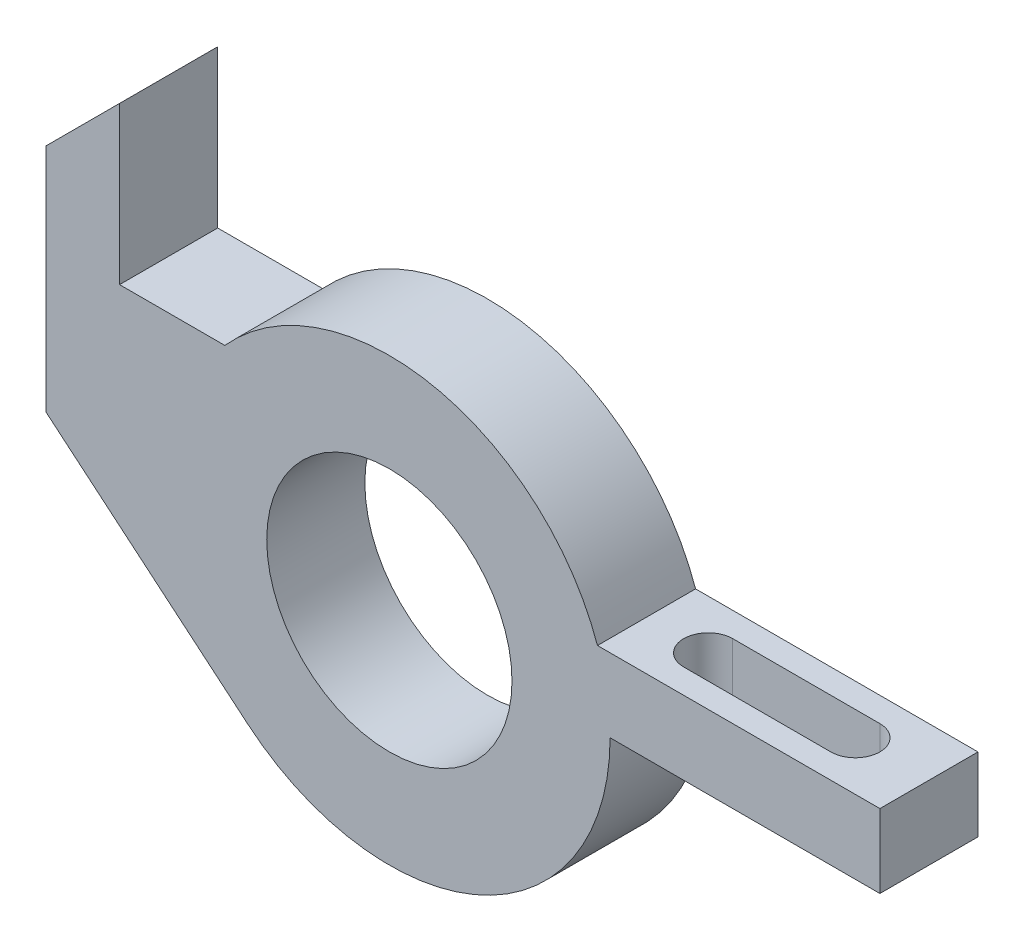
ISO-10303-21;
HEADER;
FILE_DESCRIPTION(('STEP AP214'),'2;1');
FILE_NAME('part.step','',(''),(''),'','','');
FILE_SCHEMA(('AUTOMOTIVE_DESIGN { 1 0 10303 214 1 1 1 1 }'));
ENDSEC;
DATA;
#1=APPLICATION_CONTEXT('core data for automotive mechanical design processes');
#2=APPLICATION_PROTOCOL_DEFINITION('international standard','automotive_design',2000,#1);
#3=PRODUCT_CONTEXT('',#1,'mechanical');
#4=PRODUCT('Part','Part','',(#3));
#5=PRODUCT_RELATED_PRODUCT_CATEGORY('part','',(#4));
#6=PRODUCT_DEFINITION_FORMATION('','',#4);
#7=PRODUCT_DEFINITION_CONTEXT('part definition',#1,'design');
#8=PRODUCT_DEFINITION('design','',#6,#7);
#9=PRODUCT_DEFINITION_SHAPE('','',#8);
#10=(LENGTH_UNIT() NAMED_UNIT(*) SI_UNIT(.MILLI.,.METRE.));
#11=(NAMED_UNIT(*) PLANE_ANGLE_UNIT() SI_UNIT($,.RADIAN.));
#12=(NAMED_UNIT(*) SI_UNIT($,.STERADIAN.) SOLID_ANGLE_UNIT());
#13=UNCERTAINTY_MEASURE_WITH_UNIT(LENGTH_MEASURE(1.E-05),#10,'distance_accuracy_value','');
#14=(GEOMETRIC_REPRESENTATION_CONTEXT(3) GLOBAL_UNCERTAINTY_ASSIGNED_CONTEXT((#13)) GLOBAL_UNIT_ASSIGNED_CONTEXT((#10,
#11,#12)) REPRESENTATION_CONTEXT('',''));
#15=CARTESIAN_POINT('',(0.,0.,0.));
#16=DIRECTION('',(0.,0.,1.));
#17=DIRECTION('',(1.,0.,0.));
#18=AXIS2_PLACEMENT_3D('',#15,#16,#17);
#19=CARTESIAN_POINT('',(0.,0.,20.));
#20=DIRECTION('',(0.,0.,1.));
#21=DIRECTION('',(1.,0.,0.));
#22=AXIS2_PLACEMENT_3D('',#19,#20,#21);
#23=PLANE('',#22);
#24=DIRECTION('',(0.,-1.,0.));
#25=VECTOR('',#24,1.);
#26=CARTESIAN_POINT('',(-70.,0.,20.));
#27=LINE('',#26,#25);
#28=CARTESIAN_POINT('',(-70.,47.,20.));
#29=VERTEX_POINT('',#28);
#30=CARTESIAN_POINT('',(-70.,0.,20.));
#31=VERTEX_POINT('',#30);
#32=EDGE_CURVE('E178',#29,#31,#27,.T.);
#33=ORIENTED_EDGE('',*,*,#32,.T.);
#34=DIRECTION('',(0.765986092483115,-0.642857142857143,0.));
#35=VECTOR('',#34,1.);
#36=CARTESIAN_POINT('',(-70.,0.,20.));
#37=LINE('',#36,#35);
#38=CARTESIAN_POINT('',(-28.9285714285714,-34.4693741617402,20.));
#39=VERTEX_POINT('',#38);
#40=EDGE_CURVE('E181',#31,#39,#37,.T.);
#41=ORIENTED_EDGE('',*,*,#40,.T.);
#42=CARTESIAN_POINT('',(0.,0.,20.));
#43=DIRECTION('',(0.,0.,1.));
#44=DIRECTION('',(1.,0.,0.));
#45=AXIS2_PLACEMENT_3D('',#42,#43,#44);
#46=CIRCLE('',#45,45.);
#47=CARTESIAN_POINT('',(45.,0.,20.));
#48=VERTEX_POINT('',#47);
#49=EDGE_CURVE('E184',#39,#48,#46,.T.);
#50=ORIENTED_EDGE('',*,*,#49,.T.);
#51=DIRECTION('',(1.,0.,0.));
#52=VECTOR('',#51,1.);
#53=CARTESIAN_POINT('',(44.9999999999999,0.,20.));
#54=LINE('',#53,#52);
#55=CARTESIAN_POINT('',(100.,0.,20.));
#56=VERTEX_POINT('',#55);
#57=EDGE_CURVE('E186',#48,#56,#54,.T.);
#58=ORIENTED_EDGE('',*,*,#57,.T.);
#59=DIRECTION('',(0.,1.,0.));
#60=VECTOR('',#59,1.);
#61=CARTESIAN_POINT('',(100.,15.,20.));
#62=LINE('',#61,#60);
#63=CARTESIAN_POINT('',(100.,15.,20.));
#64=VERTEX_POINT('',#63);
#65=EDGE_CURVE('E188',#56,#64,#62,.T.);
#66=ORIENTED_EDGE('',*,*,#65,.T.);
#67=DIRECTION('',(-1.,0.,0.));
#68=VECTOR('',#67,1.);
#69=CARTESIAN_POINT('',(42.4264068711928,15.,20.));
#70=LINE('',#69,#68);
#71=CARTESIAN_POINT('',(42.4264068711928,15.,20.));
#72=VERTEX_POINT('',#71);
#73=EDGE_CURVE('E190',#64,#72,#70,.T.);
#74=ORIENTED_EDGE('',*,*,#73,.T.);
#75=CARTESIAN_POINT('',(0.,0.,20.));
#76=DIRECTION('',(0.,0.,1.));
#77=DIRECTION('',(1.,0.,0.));
#78=AXIS2_PLACEMENT_3D('',#75,#76,#77);
#79=CIRCLE('',#78,45.);
#80=CARTESIAN_POINT('',(-33.5410196624968,30.,20.));
#81=VERTEX_POINT('',#80);
#82=EDGE_CURVE('E192',#72,#81,#79,.T.);
#83=ORIENTED_EDGE('',*,*,#82,.T.);
#84=DIRECTION('',(-1.,0.,0.));
#85=VECTOR('',#84,1.);
#86=CARTESIAN_POINT('',(-55.,30.,20.));
#87=LINE('',#86,#85);
#88=CARTESIAN_POINT('',(-55.,30.,20.));
#89=VERTEX_POINT('',#88);
#90=EDGE_CURVE('E194',#81,#89,#87,.T.);
#91=ORIENTED_EDGE('',*,*,#90,.T.);
#92=DIRECTION('',(0.,1.,0.));
#93=VECTOR('',#92,1.);
#94=CARTESIAN_POINT('',(-55.,62.,20.));
#95=LINE('',#94,#93);
#96=CARTESIAN_POINT('',(-55.,62.,20.));
#97=VERTEX_POINT('',#96);
#98=EDGE_CURVE('E196',#89,#97,#95,.T.);
#99=ORIENTED_EDGE('',*,*,#98,.T.);
#100=DIRECTION('',(-0.707106781186547,-0.707106781186548,0.));
#101=VECTOR('',#100,1.);
#102=CARTESIAN_POINT('',(-70.,47.,20.));
#103=LINE('',#102,#101);
#104=EDGE_CURVE('E198',#97,#29,#103,.T.);
#105=ORIENTED_EDGE('',*,*,#104,.T.);
#106=EDGE_LOOP('',(#33,#41,#50,#58,#66,#74,#83,#91,#99,#105));
#107=FACE_BOUND('',#106,.T.);
#108=CARTESIAN_POINT('',(0.,0.,20.));
#109=DIRECTION('',(0.,0.,1.));
#110=DIRECTION('',(1.,0.,0.));
#111=AXIS2_PLACEMENT_3D('',#108,#109,#110);
#112=CIRCLE('',#111,25.);
#113=CARTESIAN_POINT('',(25.,0.,20.));
#114=VERTEX_POINT('',#113);
#115=EDGE_CURVE('E172',#114,#114,#112,.T.);
#116=ORIENTED_EDGE('',*,*,#115,.F.);
#117=EDGE_LOOP('',(#116));
#118=FACE_BOUND('',#117,.T.);
#119=ADVANCED_FACE('F33',(#107,#118),#23,.T.);
#120=CARTESIAN_POINT('',(0.,0.,0.));
#121=DIRECTION('',(0.,0.,1.));
#122=DIRECTION('',(1.,0.,0.));
#123=AXIS2_PLACEMENT_3D('',#120,#121,#122);
#124=PLANE('',#123);
#125=DIRECTION('',(0.,-1.,0.));
#126=VECTOR('',#125,1.);
#127=CARTESIAN_POINT('',(-70.,0.,0.));
#128=LINE('',#127,#126);
#129=CARTESIAN_POINT('',(-70.,47.,0.));
#130=VERTEX_POINT('',#129);
#131=CARTESIAN_POINT('',(-70.,0.,0.));
#132=VERTEX_POINT('',#131);
#133=EDGE_CURVE('E175',#130,#132,#128,.T.);
#134=ORIENTED_EDGE('',*,*,#133,.F.);
#135=DIRECTION('',(-0.707106781186547,-0.707106781186548,0.));
#136=VECTOR('',#135,1.);
#137=CARTESIAN_POINT('',(-70.,47.,0.));
#138=LINE('',#137,#136);
#139=CARTESIAN_POINT('',(-55.,62.,0.));
#140=VERTEX_POINT('',#139);
#141=EDGE_CURVE('E182',#140,#130,#138,.T.);
#142=ORIENTED_EDGE('',*,*,#141,.F.);
#143=DIRECTION('',(0.,1.,0.));
#144=VECTOR('',#143,1.);
#145=CARTESIAN_POINT('',(-55.,62.,0.));
#146=LINE('',#145,#144);
#147=CARTESIAN_POINT('',(-55.,30.,0.));
#148=VERTEX_POINT('',#147);
#149=EDGE_CURVE('E217',#148,#140,#146,.T.);
#150=ORIENTED_EDGE('',*,*,#149,.F.);
#151=DIRECTION('',(-1.,0.,0.));
#152=VECTOR('',#151,1.);
#153=CARTESIAN_POINT('',(-55.,30.,0.));
#154=LINE('',#153,#152);
#155=CARTESIAN_POINT('',(-33.5410196624968,30.,0.));
#156=VERTEX_POINT('',#155);
#157=EDGE_CURVE('E215',#156,#148,#154,.T.);
#158=ORIENTED_EDGE('',*,*,#157,.F.);
#159=CARTESIAN_POINT('',(0.,0.,0.));
#160=DIRECTION('',(0.,0.,1.));
#161=DIRECTION('',(1.,0.,0.));
#162=AXIS2_PLACEMENT_3D('',#159,#160,#161);
#163=CIRCLE('',#162,45.);
#164=CARTESIAN_POINT('',(42.4264068711928,15.,0.));
#165=VERTEX_POINT('',#164);
#166=EDGE_CURVE('E213',#165,#156,#163,.T.);
#167=ORIENTED_EDGE('',*,*,#166,.F.);
#168=DIRECTION('',(-1.,0.,0.));
#169=VECTOR('',#168,1.);
#170=CARTESIAN_POINT('',(42.4264068711928,15.,0.));
#171=LINE('',#170,#169);
#172=CARTESIAN_POINT('',(100.,15.,0.));
#173=VERTEX_POINT('',#172);
#174=EDGE_CURVE('E211',#173,#165,#171,.T.);
#175=ORIENTED_EDGE('',*,*,#174,.F.);
#176=DIRECTION('',(0.,1.,0.));
#177=VECTOR('',#176,1.);
#178=CARTESIAN_POINT('',(100.,15.,0.));
#179=LINE('',#178,#177);
#180=CARTESIAN_POINT('',(100.,0.,0.));
#181=VERTEX_POINT('',#180);
#182=EDGE_CURVE('E209',#181,#173,#179,.T.);
#183=ORIENTED_EDGE('',*,*,#182,.F.);
#184=DIRECTION('',(1.,0.,0.));
#185=VECTOR('',#184,1.);
#186=CARTESIAN_POINT('',(44.9999999999999,0.,0.));
#187=LINE('',#186,#185);
#188=CARTESIAN_POINT('',(45.,0.,0.));
#189=VERTEX_POINT('',#188);
#190=EDGE_CURVE('E207',#189,#181,#187,.T.);
#191=ORIENTED_EDGE('',*,*,#190,.F.);
#192=CARTESIAN_POINT('',(0.,0.,0.));
#193=DIRECTION('',(0.,0.,1.));
#194=DIRECTION('',(1.,0.,0.));
#195=AXIS2_PLACEMENT_3D('',#192,#193,#194);
#196=CIRCLE('',#195,45.);
#197=CARTESIAN_POINT('',(-28.9285714285714,-34.4693741617402,0.));
#198=VERTEX_POINT('',#197);
#199=EDGE_CURVE('E205',#198,#189,#196,.T.);
#200=ORIENTED_EDGE('',*,*,#199,.F.);
#201=DIRECTION('',(0.765986092483115,-0.642857142857143,0.));
#202=VECTOR('',#201,1.);
#203=CARTESIAN_POINT('',(-70.,0.,0.));
#204=LINE('',#203,#202);
#205=EDGE_CURVE('E203',#132,#198,#204,.T.);
#206=ORIENTED_EDGE('',*,*,#205,.F.);
#207=EDGE_LOOP('',(#134,#142,#150,#158,#167,#175,#183,#191,#200,#206));
#208=FACE_BOUND('',#207,.T.);
#209=CARTESIAN_POINT('',(0.,0.,0.));
#210=DIRECTION('',(0.,0.,1.));
#211=DIRECTION('',(1.,0.,0.));
#212=AXIS2_PLACEMENT_3D('',#209,#210,#211);
#213=CIRCLE('',#212,25.);
#214=CARTESIAN_POINT('',(25.,0.,0.));
#215=VERTEX_POINT('',#214);
#216=EDGE_CURVE('E171',#215,#215,#213,.T.);
#217=ORIENTED_EDGE('',*,*,#216,.T.);
#218=EDGE_LOOP('',(#217));
#219=FACE_BOUND('',#218,.T.);
#220=ADVANCED_FACE('F253',(#208,#219),#124,.F.);
#221=CARTESIAN_POINT('',(-70.,0.,20.));
#222=DIRECTION('',(1.,0.,0.));
#223=DIRECTION('',(0.,0.,-1.));
#224=AXIS2_PLACEMENT_3D('',#221,#222,#223);
#225=PLANE('',#224);
#226=ORIENTED_EDGE('',*,*,#133,.T.);
#227=DIRECTION('',(0.,0.,-1.));
#228=VECTOR('',#227,1.);
#229=CARTESIAN_POINT('',(-70.,0.,20.));
#230=LINE('',#229,#228);
#231=EDGE_CURVE('E11',#31,#132,#230,.T.);
#232=ORIENTED_EDGE('',*,*,#231,.F.);
#233=ORIENTED_EDGE('',*,*,#32,.F.);
#234=DIRECTION('',(0.,0.,-1.));
#235=VECTOR('',#234,1.);
#236=CARTESIAN_POINT('',(-70.,47.,20.));
#237=LINE('',#236,#235);
#238=EDGE_CURVE('E200',#29,#130,#237,.T.);
#239=ORIENTED_EDGE('',*,*,#238,.T.);
#240=EDGE_LOOP('',(#226,#232,#233,#239));
#241=FACE_BOUND('',#240,.T.);
#242=ADVANCED_FACE('F35',(#241),#225,.F.);
#243=CARTESIAN_POINT('',(-70.,0.,20.));
#244=DIRECTION('',(0.642857142857143,0.765986092483115,0.));
#245=DIRECTION('',(-0.765986092483115,0.642857142857143,0.));
#246=AXIS2_PLACEMENT_3D('',#243,#244,#245);
#247=PLANE('',#246);
#248=ORIENTED_EDGE('',*,*,#205,.T.);
#249=DIRECTION('',(0.,0.,-1.));
#250=VECTOR('',#249,1.);
#251=CARTESIAN_POINT('',(-28.9285714285714,-34.4693741617402,20.));
#252=LINE('',#251,#250);
#253=EDGE_CURVE('E41',#39,#198,#252,.T.);
#254=ORIENTED_EDGE('',*,*,#253,.F.);
#255=ORIENTED_EDGE('',*,*,#40,.F.);
#256=ORIENTED_EDGE('',*,*,#231,.T.);
#257=EDGE_LOOP('',(#248,#254,#255,#256));
#258=FACE_BOUND('',#257,.T.);
#259=ADVANCED_FACE('F271',(#258),#247,.F.);
#260=CARTESIAN_POINT('',(0.,0.,20.));
#261=DIRECTION('',(0.,0.,-1.));
#262=DIRECTION('',(-1.,0.,0.));
#263=AXIS2_PLACEMENT_3D('',#260,#261,#262);
#264=CYLINDRICAL_SURFACE('',#263,45.);
#265=ORIENTED_EDGE('',*,*,#199,.T.);
#266=DIRECTION('',(0.,0.,-1.));
#267=VECTOR('',#266,1.);
#268=CARTESIAN_POINT('',(45.,0.,20.));
#269=LINE('',#268,#267);
#270=EDGE_CURVE('E240',#48,#189,#269,.T.);
#271=ORIENTED_EDGE('',*,*,#270,.F.);
#272=ORIENTED_EDGE('',*,*,#49,.F.);
#273=ORIENTED_EDGE('',*,*,#253,.T.);
#274=EDGE_LOOP('',(#265,#271,#272,#273));
#275=FACE_BOUND('',#274,.T.);
#276=ADVANCED_FACE('F247',(#275),#264,.T.);
#277=CARTESIAN_POINT('',(44.9999999999999,0.,20.));
#278=DIRECTION('',(0.,1.,0.));
#279=DIRECTION('',(0.,0.,1.));
#280=AXIS2_PLACEMENT_3D('',#277,#278,#279);
#281=PLANE('',#280);
#282=DIRECTION('',(-1.,0.,0.));
#283=VECTOR('',#282,1.);
#284=CARTESIAN_POINT('',(44.9999999999999,0.,4.99999999999999));
#285=LINE('',#284,#283);
#286=CARTESIAN_POINT('',(85.,0.,4.99999999999999));
#287=VERTEX_POINT('',#286);
#288=CARTESIAN_POINT('',(55.,0.,4.99999999999999));
#289=VERTEX_POINT('',#288);
#290=EDGE_CURVE('E165',#287,#289,#285,.T.);
#291=ORIENTED_EDGE('',*,*,#290,.T.);
#292=CARTESIAN_POINT('',(55.,0.,10.));
#293=DIRECTION('',(0.,1.,0.));
#294=DIRECTION('',(0.,0.,1.));
#295=AXIS2_PLACEMENT_3D('',#292,#293,#294);
#296=CIRCLE('',#295,5.00000000000001);
#297=CARTESIAN_POINT('',(55.,0.,15.));
#298=VERTEX_POINT('',#297);
#299=EDGE_CURVE('E168',#289,#298,#296,.T.);
#300=ORIENTED_EDGE('',*,*,#299,.T.);
#301=DIRECTION('',(1.,0.,0.));
#302=VECTOR('',#301,1.);
#303=CARTESIAN_POINT('',(44.9999999999999,0.,15.));
#304=LINE('',#303,#302);
#305=CARTESIAN_POINT('',(85.,0.,15.));
#306=VERTEX_POINT('',#305);
#307=EDGE_CURVE('E160',#298,#306,#304,.T.);
#308=ORIENTED_EDGE('',*,*,#307,.T.);
#309=CARTESIAN_POINT('',(85.,0.,9.99999999999999));
#310=DIRECTION('',(0.,1.,0.));
#311=DIRECTION('',(0.,0.,1.));
#312=AXIS2_PLACEMENT_3D('',#309,#310,#311);
#313=CIRCLE('',#312,5.);
#314=EDGE_CURVE('E140',#306,#287,#313,.T.);
#315=ORIENTED_EDGE('',*,*,#314,.T.);
#316=EDGE_LOOP('',(#291,#300,#308,#315));
#317=FACE_BOUND('',#316,.T.);
#318=ORIENTED_EDGE('',*,*,#190,.T.);
#319=DIRECTION('',(0.,0.,-1.));
#320=VECTOR('',#319,1.);
#321=CARTESIAN_POINT('',(100.,0.,20.));
#322=LINE('',#321,#320);
#323=EDGE_CURVE('E237',#56,#181,#322,.T.);
#324=ORIENTED_EDGE('',*,*,#323,.F.);
#325=ORIENTED_EDGE('',*,*,#57,.F.);
#326=ORIENTED_EDGE('',*,*,#270,.T.);
#327=EDGE_LOOP('',(#318,#324,#325,#326));
#328=FACE_BOUND('',#327,.T.);
#329=ADVANCED_FACE('F259',(#317,#328),#281,.F.);
#330=CARTESIAN_POINT('',(100.,15.,20.));
#331=DIRECTION('',(-1.,0.,0.));
#332=DIRECTION('',(0.,0.,1.));
#333=AXIS2_PLACEMENT_3D('',#330,#331,#332);
#334=PLANE('',#333);
#335=ORIENTED_EDGE('',*,*,#182,.T.);
#336=DIRECTION('',(0.,0.,-1.));
#337=VECTOR('',#336,1.);
#338=CARTESIAN_POINT('',(100.,15.,20.));
#339=LINE('',#338,#337);
#340=EDGE_CURVE('E234',#64,#173,#339,.T.);
#341=ORIENTED_EDGE('',*,*,#340,.F.);
#342=ORIENTED_EDGE('',*,*,#65,.F.);
#343=ORIENTED_EDGE('',*,*,#323,.T.);
#344=EDGE_LOOP('',(#335,#341,#342,#343));
#345=FACE_BOUND('',#344,.T.);
#346=ADVANCED_FACE('F263',(#345),#334,.F.);
#347=CARTESIAN_POINT('',(42.4264068711928,15.,20.));
#348=DIRECTION('',(0.,-1.,0.));
#349=DIRECTION('',(0.,0.,-1.));
#350=AXIS2_PLACEMENT_3D('',#347,#348,#349);
#351=PLANE('',#350);
#352=DIRECTION('',(1.,0.,0.));
#353=VECTOR('',#352,1.);
#354=CARTESIAN_POINT('',(55.,15.,15.));
#355=LINE('',#354,#353);
#356=CARTESIAN_POINT('',(55.,15.,15.));
#357=VERTEX_POINT('',#356);
#358=CARTESIAN_POINT('',(85.,15.,15.));
#359=VERTEX_POINT('',#358);
#360=EDGE_CURVE('E146',#357,#359,#355,.T.);
#361=ORIENTED_EDGE('',*,*,#360,.F.);
#362=CARTESIAN_POINT('',(55.,15.,10.));
#363=DIRECTION('',(0.,1.,0.));
#364=DIRECTION('',(-1.,0.,0.));
#365=AXIS2_PLACEMENT_3D('',#362,#363,#364);
#366=CIRCLE('',#365,5.00000000000001);
#367=CARTESIAN_POINT('',(55.,15.,4.99999999999999));
#368=VERTEX_POINT('',#367);
#369=EDGE_CURVE('E56',#368,#357,#366,.T.);
#370=ORIENTED_EDGE('',*,*,#369,.F.);
#371=DIRECTION('',(-1.,0.,0.));
#372=VECTOR('',#371,1.);
#373=CARTESIAN_POINT('',(55.,15.,4.99999999999999));
#374=LINE('',#373,#372);
#375=CARTESIAN_POINT('',(85.,15.,4.99999999999999));
#376=VERTEX_POINT('',#375);
#377=EDGE_CURVE('E153',#376,#368,#374,.T.);
#378=ORIENTED_EDGE('',*,*,#377,.F.);
#379=CARTESIAN_POINT('',(85.,15.,9.99999999999999));
#380=DIRECTION('',(0.,1.,0.));
#381=DIRECTION('',(-1.,0.,0.));
#382=AXIS2_PLACEMENT_3D('',#379,#380,#381);
#383=CIRCLE('',#382,5.);
#384=EDGE_CURVE('E137',#359,#376,#383,.T.);
#385=ORIENTED_EDGE('',*,*,#384,.F.);
#386=EDGE_LOOP('',(#361,#370,#378,#385));
#387=FACE_BOUND('',#386,.T.);
#388=ORIENTED_EDGE('',*,*,#174,.T.);
#389=DIRECTION('',(0.,0.,-1.));
#390=VECTOR('',#389,1.);
#391=CARTESIAN_POINT('',(42.4264068711928,15.,20.));
#392=LINE('',#391,#390);
#393=EDGE_CURVE('E231',#72,#165,#392,.T.);
#394=ORIENTED_EDGE('',*,*,#393,.F.);
#395=ORIENTED_EDGE('',*,*,#73,.F.);
#396=ORIENTED_EDGE('',*,*,#340,.T.);
#397=EDGE_LOOP('',(#388,#394,#395,#396));
#398=FACE_BOUND('',#397,.T.);
#399=ADVANCED_FACE('F150',(#387,#398),#351,.F.);
#400=CARTESIAN_POINT('',(0.,0.,20.));
#401=DIRECTION('',(0.,0.,-1.));
#402=DIRECTION('',(-1.,0.,0.));
#403=AXIS2_PLACEMENT_3D('',#400,#401,#402);
#404=CYLINDRICAL_SURFACE('',#403,45.);
#405=ORIENTED_EDGE('',*,*,#166,.T.);
#406=DIRECTION('',(0.,0.,-1.));
#407=VECTOR('',#406,1.);
#408=CARTESIAN_POINT('',(-33.5410196624968,30.,20.));
#409=LINE('',#408,#407);
#410=EDGE_CURVE('E228',#81,#156,#409,.T.);
#411=ORIENTED_EDGE('',*,*,#410,.F.);
#412=ORIENTED_EDGE('',*,*,#82,.F.);
#413=ORIENTED_EDGE('',*,*,#393,.T.);
#414=EDGE_LOOP('',(#405,#411,#412,#413));
#415=FACE_BOUND('',#414,.T.);
#416=ADVANCED_FACE('F291',(#415),#404,.T.);
#417=CARTESIAN_POINT('',(-55.,30.,20.));
#418=DIRECTION('',(0.,-1.,0.));
#419=DIRECTION('',(0.,0.,-1.));
#420=AXIS2_PLACEMENT_3D('',#417,#418,#419);
#421=PLANE('',#420);
#422=ORIENTED_EDGE('',*,*,#157,.T.);
#423=DIRECTION('',(0.,0.,-1.));
#424=VECTOR('',#423,1.);
#425=CARTESIAN_POINT('',(-55.,30.,20.));
#426=LINE('',#425,#424);
#427=EDGE_CURVE('E225',#89,#148,#426,.T.);
#428=ORIENTED_EDGE('',*,*,#427,.F.);
#429=ORIENTED_EDGE('',*,*,#90,.F.);
#430=ORIENTED_EDGE('',*,*,#410,.T.);
#431=EDGE_LOOP('',(#422,#428,#429,#430));
#432=FACE_BOUND('',#431,.T.);
#433=ADVANCED_FACE('F287',(#432),#421,.F.);
#434=CARTESIAN_POINT('',(-55.,62.,20.));
#435=DIRECTION('',(-1.,0.,0.));
#436=DIRECTION('',(0.,-1.,0.));
#437=AXIS2_PLACEMENT_3D('',#434,#435,#436);
#438=PLANE('',#437);
#439=ORIENTED_EDGE('',*,*,#149,.T.);
#440=DIRECTION('',(0.,0.,-1.));
#441=VECTOR('',#440,1.);
#442=CARTESIAN_POINT('',(-55.,62.,20.));
#443=LINE('',#442,#441);
#444=EDGE_CURVE('E222',#97,#140,#443,.T.);
#445=ORIENTED_EDGE('',*,*,#444,.F.);
#446=ORIENTED_EDGE('',*,*,#98,.F.);
#447=ORIENTED_EDGE('',*,*,#427,.T.);
#448=EDGE_LOOP('',(#439,#445,#446,#447));
#449=FACE_BOUND('',#448,.T.);
#450=ADVANCED_FACE('F283',(#449),#438,.F.);
#451=CARTESIAN_POINT('',(-70.,47.,20.));
#452=DIRECTION('',(0.707106781186548,-0.707106781186547,0.));
#453=DIRECTION('',(0.707106781186547,0.707106781186548,0.));
#454=AXIS2_PLACEMENT_3D('',#451,#452,#453);
#455=PLANE('',#454);
#456=ORIENTED_EDGE('',*,*,#141,.T.);
#457=ORIENTED_EDGE('',*,*,#238,.F.);
#458=ORIENTED_EDGE('',*,*,#104,.F.);
#459=ORIENTED_EDGE('',*,*,#444,.T.);
#460=EDGE_LOOP('',(#456,#457,#458,#459));
#461=FACE_BOUND('',#460,.T.);
#462=ADVANCED_FACE('F278',(#461),#455,.F.);
#463=CARTESIAN_POINT('',(0.,0.,20.));
#464=DIRECTION('',(0.,0.,-1.));
#465=DIRECTION('',(-1.,0.,0.));
#466=AXIS2_PLACEMENT_3D('',#463,#464,#465);
#467=CYLINDRICAL_SURFACE('',#466,25.);
#468=ORIENTED_EDGE('',*,*,#115,.T.);
#469=EDGE_LOOP('',(#468));
#470=FACE_BOUND('',#469,.T.);
#471=ORIENTED_EDGE('',*,*,#216,.F.);
#472=EDGE_LOOP('',(#471));
#473=FACE_BOUND('',#472,.T.);
#474=ADVANCED_FACE('F308',(#470,#473),#467,.F.);
#475=CARTESIAN_POINT('',(55.,-45.,10.));
#476=DIRECTION('',(0.,1.,0.));
#477=DIRECTION('',(-1.,0.,0.));
#478=AXIS2_PLACEMENT_3D('',#475,#476,#477);
#479=CYLINDRICAL_SURFACE('',#478,5.00000000000001);
#480=DIRECTION('',(0.,1.,0.));
#481=VECTOR('',#480,1.);
#482=CARTESIAN_POINT('',(55.,-45.,4.99999999999999));
#483=LINE('',#482,#481);
#484=EDGE_CURVE('E158',#289,#368,#483,.T.);
#485=ORIENTED_EDGE('',*,*,#484,.T.);
#486=ORIENTED_EDGE('',*,*,#369,.T.);
#487=DIRECTION('',(0.,1.,0.));
#488=VECTOR('',#487,1.);
#489=CARTESIAN_POINT('',(55.,-45.,15.));
#490=LINE('',#489,#488);
#491=EDGE_CURVE('E143',#298,#357,#490,.T.);
#492=ORIENTED_EDGE('',*,*,#491,.F.);
#493=ORIENTED_EDGE('',*,*,#299,.F.);
#494=EDGE_LOOP('',(#485,#486,#492,#493));
#495=FACE_BOUND('',#494,.T.);
#496=ADVANCED_FACE('F334',(#495),#479,.F.);
#497=CARTESIAN_POINT('',(55.,-45.,4.99999999999999));
#498=DIRECTION('',(0.,0.,-1.));
#499=DIRECTION('',(-1.,0.,0.));
#500=AXIS2_PLACEMENT_3D('',#497,#498,#499);
#501=PLANE('',#500);
#502=DIRECTION('',(0.,1.,0.));
#503=VECTOR('',#502,1.);
#504=CARTESIAN_POINT('',(85.,-45.,4.99999999999999));
#505=LINE('',#504,#503);
#506=EDGE_CURVE('E142',#287,#376,#505,.T.);
#507=ORIENTED_EDGE('',*,*,#506,.T.);
#508=ORIENTED_EDGE('',*,*,#377,.T.);
#509=ORIENTED_EDGE('',*,*,#484,.F.);
#510=ORIENTED_EDGE('',*,*,#290,.F.);
#511=EDGE_LOOP('',(#507,#508,#509,#510));
#512=FACE_BOUND('',#511,.T.);
#513=ADVANCED_FACE('F342',(#512),#501,.F.);
#514=CARTESIAN_POINT('',(85.,-45.,9.99999999999999));
#515=DIRECTION('',(0.,1.,0.));
#516=DIRECTION('',(-1.,0.,0.));
#517=AXIS2_PLACEMENT_3D('',#514,#515,#516);
#518=CYLINDRICAL_SURFACE('',#517,5.);
#519=DIRECTION('',(0.,1.,0.));
#520=VECTOR('',#519,1.);
#521=CARTESIAN_POINT('',(85.,-45.,15.));
#522=LINE('',#521,#520);
#523=EDGE_CURVE('E48',#306,#359,#522,.T.);
#524=ORIENTED_EDGE('',*,*,#523,.T.);
#525=ORIENTED_EDGE('',*,*,#384,.T.);
#526=ORIENTED_EDGE('',*,*,#506,.F.);
#527=ORIENTED_EDGE('',*,*,#314,.F.);
#528=EDGE_LOOP('',(#524,#525,#526,#527));
#529=FACE_BOUND('',#528,.T.);
#530=ADVANCED_FACE('F134',(#529),#518,.F.);
#531=CARTESIAN_POINT('',(55.,-45.,15.));
#532=DIRECTION('',(0.,0.,1.));
#533=DIRECTION('',(1.,0.,0.));
#534=AXIS2_PLACEMENT_3D('',#531,#532,#533);
#535=PLANE('',#534);
#536=ORIENTED_EDGE('',*,*,#491,.T.);
#537=ORIENTED_EDGE('',*,*,#360,.T.);
#538=ORIENTED_EDGE('',*,*,#523,.F.);
#539=ORIENTED_EDGE('',*,*,#307,.F.);
#540=EDGE_LOOP('',(#536,#537,#538,#539));
#541=FACE_BOUND('',#540,.T.);
#542=ADVANCED_FACE('F147',(#541),#535,.F.);
#543=CLOSED_SHELL('',(#119,#220,#242,#259,#276,#329,#346,#399,#416,#433,#450,#462,#474,#496,
#513,#530,#542));
#544=MANIFOLD_SOLID_BREP('B2',#543);
#545=ADVANCED_BREP_SHAPE_REPRESENTATION('',(#18,#544),#14);
#546=SHAPE_DEFINITION_REPRESENTATION(#9,#545);
ENDSEC;
END-ISO-10303-21;
